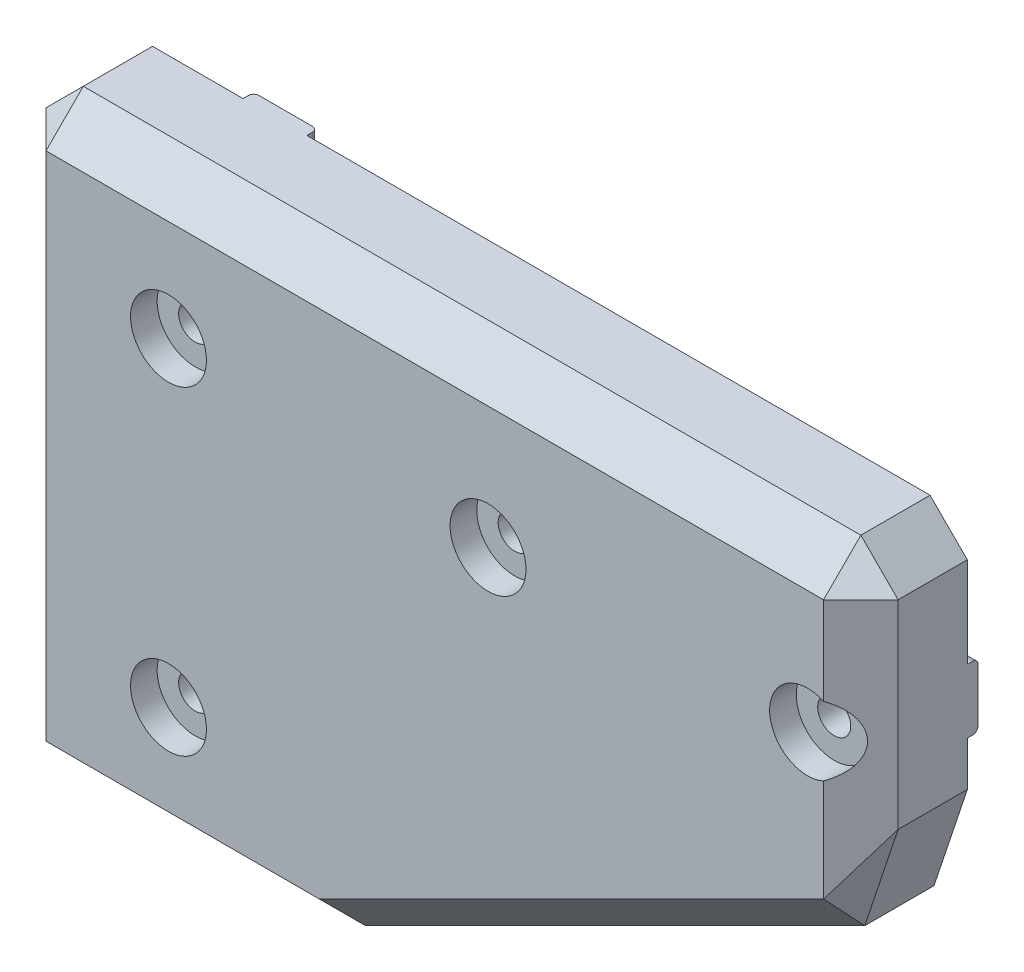
ISO-10303-21;
HEADER;
FILE_DESCRIPTION(('STEP AP214'),'2;1');
FILE_NAME('part.step','',(''),(''),'','','');
FILE_SCHEMA(('AUTOMOTIVE_DESIGN { 1 0 10303 214 1 1 1 1 }'));
ENDSEC;
DATA;
#1=APPLICATION_CONTEXT('core data for automotive mechanical design processes');
#2=APPLICATION_PROTOCOL_DEFINITION('international standard','automotive_design',2000,#1);
#3=PRODUCT_CONTEXT('',#1,'mechanical');
#4=PRODUCT('Part','Part','',(#3));
#5=PRODUCT_RELATED_PRODUCT_CATEGORY('part','',(#4));
#6=PRODUCT_DEFINITION_FORMATION('','',#4);
#7=PRODUCT_DEFINITION_CONTEXT('part definition',#1,'design');
#8=PRODUCT_DEFINITION('design','',#6,#7);
#9=PRODUCT_DEFINITION_SHAPE('','',#8);
#10=(LENGTH_UNIT() NAMED_UNIT(*) SI_UNIT(.MILLI.,.METRE.));
#11=(NAMED_UNIT(*) PLANE_ANGLE_UNIT() SI_UNIT($,.RADIAN.));
#12=(NAMED_UNIT(*) SI_UNIT($,.STERADIAN.) SOLID_ANGLE_UNIT());
#13=UNCERTAINTY_MEASURE_WITH_UNIT(LENGTH_MEASURE(1.E-05),#10,'distance_accuracy_value','');
#14=(GEOMETRIC_REPRESENTATION_CONTEXT(3) GLOBAL_UNCERTAINTY_ASSIGNED_CONTEXT((#13)) GLOBAL_UNIT_ASSIGNED_CONTEXT((#10,
#11,#12)) REPRESENTATION_CONTEXT('',''));
#15=CARTESIAN_POINT('',(0.,0.,0.));
#16=DIRECTION('',(0.,0.,1.));
#17=DIRECTION('',(1.,0.,0.));
#18=AXIS2_PLACEMENT_3D('',#15,#16,#17);
#19=CARTESIAN_POINT('',(0.,0.,0.));
#20=DIRECTION('',(0.,0.,1.));
#21=DIRECTION('',(1.,0.,0.));
#22=AXIS2_PLACEMENT_3D('',#19,#20,#21);
#23=PLANE('',#22);
#24=DIRECTION('',(-1.,0.,0.));
#25=VECTOR('',#24,1.);
#26=CARTESIAN_POINT('',(160.,110.,0.));
#27=LINE('',#26,#25);
#28=CARTESIAN_POINT('',(24.,110.,0.));
#29=VERTEX_POINT('',#28);
#30=CARTESIAN_POINT('',(7.00000000000001,110.,0.));
#31=VERTEX_POINT('',#30);
#32=EDGE_CURVE('E228',#29,#31,#27,.T.);
#33=ORIENTED_EDGE('',*,*,#32,.F.);
#34=DIRECTION('',(0.,-1.,0.));
#35=VECTOR('',#34,1.);
#36=CARTESIAN_POINT('',(24.,0.,0.));
#37=LINE('',#36,#35);
#38=CARTESIAN_POINT('',(24.,0.,0.));
#39=VERTEX_POINT('',#38);
#40=EDGE_CURVE('E213',#29,#39,#37,.T.);
#41=ORIENTED_EDGE('',*,*,#40,.T.);
#42=DIRECTION('',(1.,0.,0.));
#43=VECTOR('',#42,1.);
#44=CARTESIAN_POINT('',(0.,0.,0.));
#45=LINE('',#44,#43);
#46=CARTESIAN_POINT('',(6.99999999999998,0.,0.));
#47=VERTEX_POINT('',#46);
#48=EDGE_CURVE('E225',#47,#39,#45,.T.);
#49=ORIENTED_EDGE('',*,*,#48,.F.);
#50=DIRECTION('',(0.707106781186546,-0.707106781186549,0.));
#51=VECTOR('',#50,1.);
#52=CARTESIAN_POINT('',(6.99999999999998,0.,0.));
#53=LINE('',#52,#51);
#54=CARTESIAN_POINT('',(0.,7.00000000000001,0.));
#55=VERTEX_POINT('',#54);
#56=EDGE_CURVE('E295',#47,#55,#53,.F.);
#57=ORIENTED_EDGE('',*,*,#56,.T.);
#58=DIRECTION('',(0.,-1.,0.));
#59=VECTOR('',#58,1.);
#60=CARTESIAN_POINT('',(0.,110.,0.));
#61=LINE('',#60,#59);
#62=CARTESIAN_POINT('',(0.,103.,0.));
#63=VERTEX_POINT('',#62);
#64=EDGE_CURVE('E245',#63,#55,#61,.T.);
#65=ORIENTED_EDGE('',*,*,#64,.F.);
#66=DIRECTION('',(-0.707106781186548,-0.707106781186547,0.));
#67=VECTOR('',#66,1.);
#68=CARTESIAN_POINT('',(0.,103.,0.));
#69=LINE('',#68,#67);
#70=EDGE_CURVE('E292',#63,#31,#69,.F.);
#71=ORIENTED_EDGE('',*,*,#70,.T.);
#72=EDGE_LOOP('',(#33,#41,#49,#57,#65,#71));
#73=FACE_BOUND('',#72,.T.);
#74=ADVANCED_FACE('F41',(#73),#23,.F.);
#75=CARTESIAN_POINT('',(150.,80.,20.));
#76=DIRECTION('',(0.,0.,-1.));
#77=DIRECTION('',(-1.,0.,0.));
#78=AXIS2_PLACEMENT_3D('',#75,#76,#77);
#79=CYLINDRICAL_SURFACE('',#78,3.09999999999999);
#80=CARTESIAN_POINT('',(150.,80.,15.));
#81=DIRECTION('',(0.,0.,1.));
#82=DIRECTION('',(1.,0.,0.));
#83=AXIS2_PLACEMENT_3D('',#80,#81,#82);
#84=CIRCLE('',#83,3.09999999999999);
#85=CARTESIAN_POINT('',(153.1,80.,15.));
#86=VERTEX_POINT('',#85);
#87=EDGE_CURVE('E275',#86,#86,#84,.T.);
#88=ORIENTED_EDGE('',*,*,#87,.T.);
#89=EDGE_LOOP('',(#88));
#90=FACE_BOUND('',#89,.T.);
#91=CARTESIAN_POINT('',(150.,80.,-2.));
#92=DIRECTION('',(0.,0.,1.));
#93=DIRECTION('',(1.,0.,0.));
#94=AXIS2_PLACEMENT_3D('',#91,#92,#93);
#95=CIRCLE('',#94,3.09999999999999);
#96=CARTESIAN_POINT('',(153.1,80.,-2.));
#97=VERTEX_POINT('',#96);
#98=EDGE_CURVE('E773',#97,#97,#95,.T.);
#99=ORIENTED_EDGE('',*,*,#98,.F.);
#100=EDGE_LOOP('',(#99));
#101=FACE_BOUND('',#100,.T.);
#102=ADVANCED_FACE('F546',(#90,#101),#79,.F.);
#103=CARTESIAN_POINT('',(90.,80.,20.));
#104=DIRECTION('',(0.,0.,-1.));
#105=DIRECTION('',(-1.,0.,0.));
#106=AXIS2_PLACEMENT_3D('',#103,#104,#105);
#107=CYLINDRICAL_SURFACE('',#106,3.1);
#108=CARTESIAN_POINT('',(90.,80.,15.));
#109=DIRECTION('',(0.,0.,1.));
#110=DIRECTION('',(1.,0.,0.));
#111=AXIS2_PLACEMENT_3D('',#108,#109,#110);
#112=CIRCLE('',#111,3.1);
#113=CARTESIAN_POINT('',(93.1,80.,15.));
#114=VERTEX_POINT('',#113);
#115=EDGE_CURVE('E271',#114,#114,#112,.T.);
#116=ORIENTED_EDGE('',*,*,#115,.T.);
#117=EDGE_LOOP('',(#116));
#118=FACE_BOUND('',#117,.T.);
#119=CARTESIAN_POINT('',(90.,80.,-2.));
#120=DIRECTION('',(0.,0.,1.));
#121=DIRECTION('',(1.,0.,0.));
#122=AXIS2_PLACEMENT_3D('',#119,#120,#121);
#123=CIRCLE('',#122,3.1);
#124=CARTESIAN_POINT('',(93.1,80.,-2.));
#125=VERTEX_POINT('',#124);
#126=EDGE_CURVE('E769',#125,#125,#123,.T.);
#127=ORIENTED_EDGE('',*,*,#126,.F.);
#128=EDGE_LOOP('',(#127));
#129=FACE_BOUND('',#128,.T.);
#130=ADVANCED_FACE('F550',(#118,#129),#107,.F.);
#131=CARTESIAN_POINT('',(30.,84.,20.));
#132=DIRECTION('',(0.,0.,-1.));
#133=DIRECTION('',(-1.,0.,0.));
#134=AXIS2_PLACEMENT_3D('',#131,#132,#133);
#135=CYLINDRICAL_SURFACE('',#134,3.10000000000001);
#136=CARTESIAN_POINT('',(30.,84.,15.));
#137=DIRECTION('',(0.,0.,1.));
#138=DIRECTION('',(1.,0.,0.));
#139=AXIS2_PLACEMENT_3D('',#136,#137,#138);
#140=CIRCLE('',#139,3.10000000000001);
#141=CARTESIAN_POINT('',(33.1,84.,15.));
#142=VERTEX_POINT('',#141);
#143=EDGE_CURVE('E266',#142,#142,#140,.T.);
#144=ORIENTED_EDGE('',*,*,#143,.T.);
#145=EDGE_LOOP('',(#144));
#146=FACE_BOUND('',#145,.T.);
#147=CARTESIAN_POINT('',(30.,84.,-2.));
#148=DIRECTION('',(0.,0.,1.));
#149=DIRECTION('',(1.,0.,0.));
#150=AXIS2_PLACEMENT_3D('',#147,#148,#149);
#151=CIRCLE('',#150,3.10000000000001);
#152=CARTESIAN_POINT('',(33.1,84.,-2.));
#153=VERTEX_POINT('',#152);
#154=EDGE_CURVE('E772',#153,#153,#151,.T.);
#155=ORIENTED_EDGE('',*,*,#154,.F.);
#156=EDGE_LOOP('',(#155));
#157=FACE_BOUND('',#156,.T.);
#158=ADVANCED_FACE('F756',(#146,#157),#135,.F.);
#159=CARTESIAN_POINT('',(30.,24.,20.));
#160=DIRECTION('',(0.,0.,-1.));
#161=DIRECTION('',(-1.,0.,0.));
#162=AXIS2_PLACEMENT_3D('',#159,#160,#161);
#163=CYLINDRICAL_SURFACE('',#162,3.1);
#164=CARTESIAN_POINT('',(30.,24.,15.));
#165=DIRECTION('',(0.,0.,1.));
#166=DIRECTION('',(1.,0.,0.));
#167=AXIS2_PLACEMENT_3D('',#164,#165,#166);
#168=CIRCLE('',#167,3.1);
#169=CARTESIAN_POINT('',(33.1,24.,15.));
#170=VERTEX_POINT('',#169);
#171=EDGE_CURVE('E262',#170,#170,#168,.T.);
#172=ORIENTED_EDGE('',*,*,#171,.T.);
#173=EDGE_LOOP('',(#172));
#174=FACE_BOUND('',#173,.T.);
#175=CARTESIAN_POINT('',(30.,24.,-2.));
#176=DIRECTION('',(0.,0.,1.));
#177=DIRECTION('',(1.,0.,0.));
#178=AXIS2_PLACEMENT_3D('',#175,#176,#177);
#179=CIRCLE('',#178,3.1);
#180=CARTESIAN_POINT('',(33.1,24.,-2.));
#181=VERTEX_POINT('',#180);
#182=EDGE_CURVE('E231',#181,#181,#179,.T.);
#183=ORIENTED_EDGE('',*,*,#182,.F.);
#184=EDGE_LOOP('',(#183));
#185=FACE_BOUND('',#184,.T.);
#186=ADVANCED_FACE('F564',(#174,#185),#163,.F.);
#187=CARTESIAN_POINT('',(0.,110.,20.));
#188=DIRECTION('',(1.,0.,0.));
#189=DIRECTION('',(0.,1.,0.));
#190=AXIS2_PLACEMENT_3D('',#187,#188,#189);
#191=PLANE('',#190);
#192=ORIENTED_EDGE('',*,*,#64,.T.);
#193=DIRECTION('',(0.,0.,1.));
#194=VECTOR('',#193,1.);
#195=CARTESIAN_POINT('',(0.,7.00000000000001,20.));
#196=LINE('',#195,#194);
#197=CARTESIAN_POINT('',(0.,7.00000000000001,13.));
#198=VERTEX_POINT('',#197);
#199=EDGE_CURVE('E318',#55,#198,#196,.T.);
#200=ORIENTED_EDGE('',*,*,#199,.T.);
#201=DIRECTION('',(0.,1.,0.));
#202=VECTOR('',#201,1.);
#203=CARTESIAN_POINT('',(0.,110.,13.));
#204=LINE('',#203,#202);
#205=CARTESIAN_POINT('',(0.,103.,13.));
#206=VERTEX_POINT('',#205);
#207=EDGE_CURVE('E312',#198,#206,#204,.T.);
#208=ORIENTED_EDGE('',*,*,#207,.T.);
#209=DIRECTION('',(0.,0.,-1.));
#210=VECTOR('',#209,1.);
#211=CARTESIAN_POINT('',(0.,103.,20.));
#212=LINE('',#211,#210);
#213=EDGE_CURVE('E315',#206,#63,#212,.T.);
#214=ORIENTED_EDGE('',*,*,#213,.T.);
#215=EDGE_LOOP('',(#192,#200,#208,#214));
#216=FACE_BOUND('',#215,.T.);
#217=ADVANCED_FACE('F561',(#216),#191,.F.);
#218=CARTESIAN_POINT('',(0.,0.,20.));
#219=DIRECTION('',(0.,1.,0.));
#220=DIRECTION('',(0.,0.,1.));
#221=AXIS2_PLACEMENT_3D('',#218,#219,#220);
#222=PLANE('',#221);
#223=DIRECTION('',(0.,0.,1.));
#224=VECTOR('',#223,1.);
#225=CARTESIAN_POINT('',(24.,0.,-2.));
#226=LINE('',#225,#224);
#227=CARTESIAN_POINT('',(24.,0.,-1.));
#228=VERTEX_POINT('',#227);
#229=EDGE_CURVE('E209',#228,#39,#226,.T.);
#230=ORIENTED_EDGE('',*,*,#229,.F.);
#231=CARTESIAN_POINT('',(25.,0.,-1.));
#232=DIRECTION('',(0.,1.,0.));
#233=DIRECTION('',(0.,0.,1.));
#234=AXIS2_PLACEMENT_3D('',#231,#232,#233);
#235=CIRCLE('',#234,1.);
#236=CARTESIAN_POINT('',(25.,0.,-2.));
#237=VERTEX_POINT('',#236);
#238=EDGE_CURVE('E411',#228,#237,#235,.F.);
#239=ORIENTED_EDGE('',*,*,#238,.T.);
#240=DIRECTION('',(1.,0.,0.));
#241=VECTOR('',#240,1.);
#242=CARTESIAN_POINT('',(36.,0.,-2.));
#243=LINE('',#242,#241);
#244=CARTESIAN_POINT('',(35.,0.,-2.));
#245=VERTEX_POINT('',#244);
#246=EDGE_CURVE('E783',#237,#245,#243,.T.);
#247=ORIENTED_EDGE('',*,*,#246,.T.);
#248=CARTESIAN_POINT('',(35.,0.,-1.));
#249=DIRECTION('',(0.,1.,0.));
#250=DIRECTION('',(0.,0.,1.));
#251=AXIS2_PLACEMENT_3D('',#248,#249,#250);
#252=CIRCLE('',#251,1.);
#253=CARTESIAN_POINT('',(36.,0.,-1.));
#254=VERTEX_POINT('',#253);
#255=EDGE_CURVE('E408',#245,#254,#252,.F.);
#256=ORIENTED_EDGE('',*,*,#255,.T.);
#257=DIRECTION('',(0.,0.,1.));
#258=VECTOR('',#257,1.);
#259=CARTESIAN_POINT('',(36.,0.,-2.));
#260=LINE('',#259,#258);
#261=CARTESIAN_POINT('',(36.,0.,0.));
#262=VERTEX_POINT('',#261);
#263=EDGE_CURVE('E220',#254,#262,#260,.T.);
#264=ORIENTED_EDGE('',*,*,#263,.T.);
#265=CARTESIAN_POINT('',(60.,0.,0.));
#266=VERTEX_POINT('',#265);
#267=EDGE_CURVE('E238',#262,#266,#45,.T.);
#268=ORIENTED_EDGE('',*,*,#267,.T.);
#269=DIRECTION('',(0.,0.,-1.));
#270=VECTOR('',#269,1.);
#271=CARTESIAN_POINT('',(60.,0.,20.));
#272=LINE('',#271,#270);
#273=CARTESIAN_POINT('',(60.,0.,13.));
#274=VERTEX_POINT('',#273);
#275=EDGE_CURVE('E257',#274,#266,#272,.T.);
#276=ORIENTED_EDGE('',*,*,#275,.F.);
#277=DIRECTION('',(-1.,0.,0.));
#278=VECTOR('',#277,1.);
#279=CARTESIAN_POINT('',(0.,0.,13.));
#280=LINE('',#279,#278);
#281=CARTESIAN_POINT('',(6.99999999999998,0.,13.));
#282=VERTEX_POINT('',#281);
#283=EDGE_CURVE('E307',#274,#282,#280,.T.);
#284=ORIENTED_EDGE('',*,*,#283,.T.);
#285=DIRECTION('',(0.,0.,-1.));
#286=VECTOR('',#285,1.);
#287=CARTESIAN_POINT('',(6.99999999999998,0.,20.));
#288=LINE('',#287,#286);
#289=EDGE_CURVE('E235',#282,#47,#288,.T.);
#290=ORIENTED_EDGE('',*,*,#289,.T.);
#291=ORIENTED_EDGE('',*,*,#48,.T.);
#292=EDGE_LOOP('',(#230,#239,#247,#256,#264,#268,#276,#284,#290,#291));
#293=FACE_BOUND('',#292,.T.);
#294=ADVANCED_FACE('F233',(#293),#222,.F.);
#295=CARTESIAN_POINT('',(60.,0.,20.));
#296=DIRECTION('',(-0.447213595499958,0.894427190999916,0.));
#297=DIRECTION('',(-0.894427190999916,-0.447213595499958,0.));
#298=AXIS2_PLACEMENT_3D('',#295,#296,#297);
#299=PLANE('',#298);
#300=DIRECTION('',(0.894427190999916,0.447213595499958,0.));
#301=VECTOR('',#300,1.);
#302=CARTESIAN_POINT('',(60.,0.,0.));
#303=LINE('',#302,#301);
#304=CARTESIAN_POINT('',(153.739009663001,46.8695048315003,0.));
#305=VERTEX_POINT('',#304);
#306=EDGE_CURVE('E237',#266,#305,#303,.T.);
#307=ORIENTED_EDGE('',*,*,#306,.T.);
#308=DIRECTION('',(0.,0.,1.));
#309=VECTOR('',#308,1.);
#310=CARTESIAN_POINT('',(153.739009663001,46.8695048315003,20.));
#311=LINE('',#310,#309);
#312=CARTESIAN_POINT('',(153.739009663001,46.8695048315003,13.));
#313=VERTEX_POINT('',#312);
#314=EDGE_CURVE('E304',#305,#313,#311,.T.);
#315=ORIENTED_EDGE('',*,*,#314,.T.);
#316=DIRECTION('',(-0.894427190999916,-0.447213595499958,0.));
#317=VECTOR('',#316,1.);
#318=CARTESIAN_POINT('',(60.,0.,13.));
#319=LINE('',#318,#317);
#320=EDGE_CURVE('E301',#313,#274,#319,.T.);
#321=ORIENTED_EDGE('',*,*,#320,.T.);
#322=ORIENTED_EDGE('',*,*,#275,.T.);
#323=EDGE_LOOP('',(#307,#315,#321,#322));
#324=FACE_BOUND('',#323,.T.);
#325=ADVANCED_FACE('F555',(#324),#299,.F.);
#326=CARTESIAN_POINT('',(160.,50.,20.));
#327=DIRECTION('',(-1.,0.,0.));
#328=DIRECTION('',(0.,0.,1.));
#329=AXIS2_PLACEMENT_3D('',#326,#327,#328);
#330=PLANE('',#329);
#331=DIRECTION('',(0.,0.,1.));
#332=VECTOR('',#331,1.);
#333=CARTESIAN_POINT('',(160.,74.,-2.));
#334=LINE('',#333,#332);
#335=CARTESIAN_POINT('',(160.,74.,-1.));
#336=VERTEX_POINT('',#335);
#337=CARTESIAN_POINT('',(160.,74.,0.));
#338=VERTEX_POINT('',#337);
#339=EDGE_CURVE('E464',#336,#338,#334,.T.);
#340=ORIENTED_EDGE('',*,*,#339,.F.);
#341=CARTESIAN_POINT('',(160.,75.,-1.));
#342=DIRECTION('',(-1.,0.,0.));
#343=DIRECTION('',(0.,0.,1.));
#344=AXIS2_PLACEMENT_3D('',#341,#342,#343);
#345=CIRCLE('',#344,1.);
#346=CARTESIAN_POINT('',(160.,75.,-2.));
#347=VERTEX_POINT('',#346);
#348=EDGE_CURVE('E437',#336,#347,#345,.F.);
#349=ORIENTED_EDGE('',*,*,#348,.T.);
#350=DIRECTION('',(0.,1.,0.));
#351=VECTOR('',#350,1.);
#352=CARTESIAN_POINT('',(160.,86.,-2.));
#353=LINE('',#352,#351);
#354=CARTESIAN_POINT('',(160.,85.,-2.));
#355=VERTEX_POINT('',#354);
#356=EDGE_CURVE('E465',#347,#355,#353,.T.);
#357=ORIENTED_EDGE('',*,*,#356,.T.);
#358=CARTESIAN_POINT('',(160.,85.,-1.));
#359=DIRECTION('',(-1.,0.,0.));
#360=DIRECTION('',(0.,0.,1.));
#361=AXIS2_PLACEMENT_3D('',#358,#359,#360);
#362=CIRCLE('',#361,1.);
#363=CARTESIAN_POINT('',(160.,86.,-1.));
#364=VERTEX_POINT('',#363);
#365=EDGE_CURVE('E434',#355,#364,#362,.F.);
#366=ORIENTED_EDGE('',*,*,#365,.T.);
#367=DIRECTION('',(0.,0.,1.));
#368=VECTOR('',#367,1.);
#369=CARTESIAN_POINT('',(160.,86.,-2.));
#370=LINE('',#369,#368);
#371=CARTESIAN_POINT('',(160.,86.,0.));
#372=VERTEX_POINT('',#371);
#373=EDGE_CURVE('E490',#364,#372,#370,.T.);
#374=ORIENTED_EDGE('',*,*,#373,.T.);
#375=DIRECTION('',(0.,1.,0.));
#376=VECTOR('',#375,1.);
#377=CARTESIAN_POINT('',(160.,50.,0.));
#378=LINE('',#377,#376);
#379=CARTESIAN_POINT('',(160.,103.,0.));
#380=VERTEX_POINT('',#379);
#381=EDGE_CURVE('E243',#372,#380,#378,.T.);
#382=ORIENTED_EDGE('',*,*,#381,.T.);
#383=DIRECTION('',(0.,0.,1.));
#384=VECTOR('',#383,1.);
#385=CARTESIAN_POINT('',(160.,103.,20.));
#386=LINE('',#385,#384);
#387=CARTESIAN_POINT('',(160.,103.,13.));
#388=VERTEX_POINT('',#387);
#389=EDGE_CURVE('E281',#380,#388,#386,.T.);
#390=ORIENTED_EDGE('',*,*,#389,.T.);
#391=DIRECTION('',(0.,-1.,0.));
#392=VECTOR('',#391,1.);
#393=CARTESIAN_POINT('',(160.,50.,13.));
#394=LINE('',#393,#392);
#395=CARTESIAN_POINT('',(160.,65.6524758424984,13.));
#396=VERTEX_POINT('',#395);
#397=EDGE_CURVE('E261',#388,#396,#394,.T.);
#398=ORIENTED_EDGE('',*,*,#397,.T.);
#399=DIRECTION('',(0.,0.,-1.));
#400=VECTOR('',#399,1.);
#401=CARTESIAN_POINT('',(160.,65.6524758424984,20.));
#402=LINE('',#401,#400);
#403=CARTESIAN_POINT('',(160.,65.6524758424984,0.));
#404=VERTEX_POINT('',#403);
#405=EDGE_CURVE('E284',#396,#404,#402,.T.);
#406=ORIENTED_EDGE('',*,*,#405,.T.);
#407=EDGE_CURVE('E249',#404,#338,#378,.T.);
#408=ORIENTED_EDGE('',*,*,#407,.T.);
#409=EDGE_LOOP('',(#340,#349,#357,#366,#374,#382,#390,#398,#406,#408));
#410=FACE_BOUND('',#409,.T.);
#411=ADVANCED_FACE('F470',(#410),#330,.F.);
#412=CARTESIAN_POINT('',(160.,110.,20.));
#413=DIRECTION('',(0.,-1.,0.));
#414=DIRECTION('',(1.,0.,0.));
#415=AXIS2_PLACEMENT_3D('',#412,#413,#414);
#416=PLANE('',#415);
#417=DIRECTION('',(-1.,0.,0.));
#418=VECTOR('',#417,1.);
#419=CARTESIAN_POINT('',(36.,110.,-2.));
#420=LINE('',#419,#418);
#421=CARTESIAN_POINT('',(35.,110.,-2.));
#422=VERTEX_POINT('',#421);
#423=CARTESIAN_POINT('',(25.,110.,-2.));
#424=VERTEX_POINT('',#423);
#425=EDGE_CURVE('E221',#422,#424,#420,.T.);
#426=ORIENTED_EDGE('',*,*,#425,.T.);
#427=CARTESIAN_POINT('',(25.,110.,-1.));
#428=DIRECTION('',(0.,-1.,0.));
#429=DIRECTION('',(1.,0.,0.));
#430=AXIS2_PLACEMENT_3D('',#427,#428,#429);
#431=CIRCLE('',#430,1.);
#432=CARTESIAN_POINT('',(24.,110.,-1.));
#433=VERTEX_POINT('',#432);
#434=EDGE_CURVE('E423',#424,#433,#431,.F.);
#435=ORIENTED_EDGE('',*,*,#434,.T.);
#436=DIRECTION('',(0.,0.,1.));
#437=VECTOR('',#436,1.);
#438=CARTESIAN_POINT('',(24.,110.,-2.));
#439=LINE('',#438,#437);
#440=EDGE_CURVE('E482',#433,#29,#439,.T.);
#441=ORIENTED_EDGE('',*,*,#440,.T.);
#442=ORIENTED_EDGE('',*,*,#32,.T.);
#443=DIRECTION('',(0.,0.,1.));
#444=VECTOR('',#443,1.);
#445=CARTESIAN_POINT('',(7.00000000000001,110.,20.));
#446=LINE('',#445,#444);
#447=CARTESIAN_POINT('',(7.00000000000001,110.,13.));
#448=VERTEX_POINT('',#447);
#449=EDGE_CURVE('E327',#31,#448,#446,.T.);
#450=ORIENTED_EDGE('',*,*,#449,.T.);
#451=DIRECTION('',(1.,0.,0.));
#452=VECTOR('',#451,1.);
#453=CARTESIAN_POINT('',(160.,110.,13.));
#454=LINE('',#453,#452);
#455=CARTESIAN_POINT('',(153.,110.,13.));
#456=VERTEX_POINT('',#455);
#457=EDGE_CURVE('E321',#448,#456,#454,.T.);
#458=ORIENTED_EDGE('',*,*,#457,.T.);
#459=DIRECTION('',(0.,0.,-1.));
#460=VECTOR('',#459,1.);
#461=CARTESIAN_POINT('',(153.,110.,20.));
#462=LINE('',#461,#460);
#463=CARTESIAN_POINT('',(153.,110.,0.));
#464=VERTEX_POINT('',#463);
#465=EDGE_CURVE('E324',#456,#464,#462,.T.);
#466=ORIENTED_EDGE('',*,*,#465,.T.);
#467=CARTESIAN_POINT('',(36.,110.,0.));
#468=VERTEX_POINT('',#467);
#469=EDGE_CURVE('E253',#464,#468,#27,.T.);
#470=ORIENTED_EDGE('',*,*,#469,.T.);
#471=DIRECTION('',(0.,0.,1.));
#472=VECTOR('',#471,1.);
#473=CARTESIAN_POINT('',(36.,110.,-2.));
#474=LINE('',#473,#472);
#475=CARTESIAN_POINT('',(36.,110.,-1.));
#476=VERTEX_POINT('',#475);
#477=EDGE_CURVE('E794',#476,#468,#474,.T.);
#478=ORIENTED_EDGE('',*,*,#477,.F.);
#479=CARTESIAN_POINT('',(35.,110.,-1.));
#480=DIRECTION('',(0.,-1.,0.));
#481=DIRECTION('',(1.,0.,0.));
#482=AXIS2_PLACEMENT_3D('',#479,#480,#481);
#483=CIRCLE('',#482,1.);
#484=EDGE_CURVE('E420',#476,#422,#483,.F.);
#485=ORIENTED_EDGE('',*,*,#484,.T.);
#486=EDGE_LOOP('',(#426,#435,#441,#442,#450,#458,#466,#470,#478,#485));
#487=FACE_BOUND('',#486,.T.);
#488=ADVANCED_FACE('F530',(#487),#416,.F.);
#489=CARTESIAN_POINT('',(0.,0.,20.));
#490=DIRECTION('',(0.,0.,1.));
#491=DIRECTION('',(1.,0.,0.));
#492=AXIS2_PLACEMENT_3D('',#489,#490,#491);
#493=PLANE('',#492);
#494=CARTESIAN_POINT('',(30.,24.,20.));
#495=DIRECTION('',(0.,0.,1.));
#496=DIRECTION('',(1.,0.,0.));
#497=AXIS2_PLACEMENT_3D('',#494,#495,#496);
#498=CIRCLE('',#497,7.12808554784318);
#499=CARTESIAN_POINT('',(37.1280855478432,24.,20.));
#500=VERTEX_POINT('',#499);
#501=EDGE_CURVE('E405',#500,#500,#498,.T.);
#502=ORIENTED_EDGE('',*,*,#501,.F.);
#503=EDGE_LOOP('',(#502));
#504=FACE_BOUND('',#503,.T.);
#505=DIRECTION('',(0.894427190999916,0.447213595499958,0.));
#506=VECTOR('',#505,1.);
#507=CARTESIAN_POINT('',(156.8695048315,56.2609903369994,20.));
#508=LINE('',#507,#506);
#509=CARTESIAN_POINT('',(58.3475241575015,6.99999999999998,20.));
#510=VERTEX_POINT('',#509);
#511=CARTESIAN_POINT('',(153.,54.3262379212493,20.));
#512=VERTEX_POINT('',#511);
#513=EDGE_CURVE('E339',#510,#512,#508,.T.);
#514=ORIENTED_EDGE('',*,*,#513,.T.);
#515=DIRECTION('',(0.,1.,0.));
#516=VECTOR('',#515,1.);
#517=CARTESIAN_POINT('',(153.,110.,20.));
#518=LINE('',#517,#516);
#519=CARTESIAN_POINT('',(153.,73.5339653900268,20.));
#520=VERTEX_POINT('',#519);
#521=EDGE_CURVE('E345',#512,#520,#518,.T.);
#522=ORIENTED_EDGE('',*,*,#521,.T.);
#523=CARTESIAN_POINT('',(150.,80.,20.));
#524=DIRECTION('',(0.,0.,1.));
#525=DIRECTION('',(1.,0.,0.));
#526=AXIS2_PLACEMENT_3D('',#523,#524,#525);
#527=CIRCLE('',#526,7.12808554784321);
#528=CARTESIAN_POINT('',(153.,86.4660346099732,20.));
#529=VERTEX_POINT('',#528);
#530=EDGE_CURVE('E508',#529,#520,#527,.T.);
#531=ORIENTED_EDGE('',*,*,#530,.F.);
#532=DIRECTION('',(0.,1.,0.));
#533=VECTOR('',#532,1.);
#534=CARTESIAN_POINT('',(153.,110.,20.));
#535=LINE('',#534,#533);
#536=CARTESIAN_POINT('',(153.,103.,20.));
#537=VERTEX_POINT('',#536);
#538=EDGE_CURVE('E342',#529,#537,#535,.T.);
#539=ORIENTED_EDGE('',*,*,#538,.T.);
#540=DIRECTION('',(-1.,0.,0.));
#541=VECTOR('',#540,1.);
#542=CARTESIAN_POINT('',(0.,103.,20.));
#543=LINE('',#542,#541);
#544=CARTESIAN_POINT('',(6.99999999999999,103.,20.));
#545=VERTEX_POINT('',#544);
#546=EDGE_CURVE('E330',#537,#545,#543,.T.);
#547=ORIENTED_EDGE('',*,*,#546,.T.);
#548=DIRECTION('',(0.,-1.,0.));
#549=VECTOR('',#548,1.);
#550=CARTESIAN_POINT('',(6.99999999999998,0.,20.));
#551=LINE('',#550,#549);
#552=CARTESIAN_POINT('',(6.99999999999998,6.99999999999998,20.));
#553=VERTEX_POINT('',#552);
#554=EDGE_CURVE('E333',#545,#553,#551,.T.);
#555=ORIENTED_EDGE('',*,*,#554,.T.);
#556=DIRECTION('',(1.,0.,0.));
#557=VECTOR('',#556,1.);
#558=CARTESIAN_POINT('',(60.,6.99999999999998,20.));
#559=LINE('',#558,#557);
#560=EDGE_CURVE('E336',#553,#510,#559,.T.);
#561=ORIENTED_EDGE('',*,*,#560,.T.);
#562=EDGE_LOOP('',(#514,#522,#531,#539,#547,#555,#561));
#563=FACE_BOUND('',#562,.T.);
#564=CARTESIAN_POINT('',(90.,80.,20.));
#565=DIRECTION('',(0.,0.,1.));
#566=DIRECTION('',(1.,0.,0.));
#567=AXIS2_PLACEMENT_3D('',#564,#565,#566);
#568=CIRCLE('',#567,7.12808554784319);
#569=CARTESIAN_POINT('',(97.1280855478432,80.,20.));
#570=VERTEX_POINT('',#569);
#571=EDGE_CURVE('E500',#570,#570,#568,.T.);
#572=ORIENTED_EDGE('',*,*,#571,.F.);
#573=EDGE_LOOP('',(#572));
#574=FACE_BOUND('',#573,.T.);
#575=CARTESIAN_POINT('',(30.,84.,20.));
#576=DIRECTION('',(0.,0.,1.));
#577=DIRECTION('',(1.,0.,0.));
#578=AXIS2_PLACEMENT_3D('',#575,#576,#577);
#579=CIRCLE('',#578,7.12808554784319);
#580=CARTESIAN_POINT('',(37.1280855478432,84.,20.));
#581=VERTEX_POINT('',#580);
#582=EDGE_CURVE('E499',#581,#581,#579,.T.);
#583=ORIENTED_EDGE('',*,*,#582,.F.);
#584=EDGE_LOOP('',(#583));
#585=FACE_BOUND('',#584,.T.);
#586=ADVANCED_FACE('F527',(#504,#563,#574,#585),#493,.T.);
#587=ORIENTED_EDGE('',*,*,#267,.F.);
#588=DIRECTION('',(0.,1.,0.));
#589=VECTOR('',#588,1.);
#590=CARTESIAN_POINT('',(36.,0.,0.));
#591=LINE('',#590,#589);
#592=EDGE_CURVE('E230',#262,#468,#591,.T.);
#593=ORIENTED_EDGE('',*,*,#592,.T.);
#594=ORIENTED_EDGE('',*,*,#469,.F.);
#595=DIRECTION('',(-0.707106781186549,0.707106781186546,0.));
#596=VECTOR('',#595,1.);
#597=CARTESIAN_POINT('',(153.,110.,0.));
#598=LINE('',#597,#596);
#599=EDGE_CURVE('E288',#464,#380,#598,.F.);
#600=ORIENTED_EDGE('',*,*,#599,.T.);
#601=ORIENTED_EDGE('',*,*,#381,.F.);
#602=DIRECTION('',(-1.,0.,0.));
#603=VECTOR('',#602,1.);
#604=CARTESIAN_POINT('',(160.,86.,0.));
#605=LINE('',#604,#603);
#606=CARTESIAN_POINT('',(65.,86.,0.));
#607=VERTEX_POINT('',#606);
#608=EDGE_CURVE('E476',#372,#607,#605,.T.);
#609=ORIENTED_EDGE('',*,*,#608,.T.);
#610=DIRECTION('',(0.,-1.,0.));
#611=VECTOR('',#610,1.);
#612=CARTESIAN_POINT('',(65.,86.,0.));
#613=LINE('',#612,#611);
#614=CARTESIAN_POINT('',(65.,74.,0.));
#615=VERTEX_POINT('',#614);
#616=EDGE_CURVE('E479',#607,#615,#613,.T.);
#617=ORIENTED_EDGE('',*,*,#616,.T.);
#618=DIRECTION('',(1.,0.,0.));
#619=VECTOR('',#618,1.);
#620=CARTESIAN_POINT('',(160.,74.,0.));
#621=LINE('',#620,#619);
#622=EDGE_CURVE('E461',#615,#338,#621,.T.);
#623=ORIENTED_EDGE('',*,*,#622,.T.);
#624=ORIENTED_EDGE('',*,*,#407,.F.);
#625=DIRECTION('',(0.31622776601684,0.948683298050513,0.));
#626=VECTOR('',#625,1.);
#627=CARTESIAN_POINT('',(160.,65.6524758424984,0.));
#628=LINE('',#627,#626);
#629=EDGE_CURVE('E298',#404,#305,#628,.F.);
#630=ORIENTED_EDGE('',*,*,#629,.T.);
#631=ORIENTED_EDGE('',*,*,#306,.F.);
#632=EDGE_LOOP('',(#587,#593,#594,#600,#601,#609,#617,#623,#624,#630,#631));
#633=FACE_BOUND('',#632,.T.);
#634=ADVANCED_FACE('F529',(#633),#23,.F.);
#635=CARTESIAN_POINT('',(30.,24.,15.));
#636=DIRECTION('',(0.,0.,1.));
#637=DIRECTION('',(1.,0.,0.));
#638=AXIS2_PLACEMENT_3D('',#635,#636,#637);
#639=CYLINDRICAL_SURFACE('',#638,7.12808554784318);
#640=CARTESIAN_POINT('',(30.,24.,15.));
#641=DIRECTION('',(0.,0.,1.));
#642=DIRECTION('',(1.,0.,0.));
#643=AXIS2_PLACEMENT_3D('',#640,#641,#642);
#644=CIRCLE('',#643,7.12808554784318);
#645=CARTESIAN_POINT('',(37.1280855478432,24.,15.));
#646=VERTEX_POINT('',#645);
#647=EDGE_CURVE('E512',#646,#646,#644,.T.);
#648=ORIENTED_EDGE('',*,*,#647,.F.);
#649=EDGE_LOOP('',(#648));
#650=FACE_BOUND('',#649,.T.);
#651=ORIENTED_EDGE('',*,*,#501,.T.);
#652=EDGE_LOOP('',(#651));
#653=FACE_BOUND('',#652,.T.);
#654=ADVANCED_FACE('F537',(#650,#653),#639,.F.);
#655=CARTESIAN_POINT('',(30.,24.,15.));
#656=DIRECTION('',(0.,0.,1.));
#657=DIRECTION('',(1.,0.,0.));
#658=AXIS2_PLACEMENT_3D('',#655,#656,#657);
#659=PLANE('',#658);
#660=ORIENTED_EDGE('',*,*,#171,.F.);
#661=EDGE_LOOP('',(#660));
#662=FACE_BOUND('',#661,.T.);
#663=ORIENTED_EDGE('',*,*,#647,.T.);
#664=EDGE_LOOP('',(#663));
#665=FACE_BOUND('',#664,.T.);
#666=ADVANCED_FACE('F740',(#662,#665),#659,.T.);
#667=CARTESIAN_POINT('',(30.,84.,15.));
#668=DIRECTION('',(0.,0.,1.));
#669=DIRECTION('',(1.,0.,0.));
#670=AXIS2_PLACEMENT_3D('',#667,#668,#669);
#671=CYLINDRICAL_SURFACE('',#670,7.12808554784319);
#672=CARTESIAN_POINT('',(30.,84.,15.));
#673=DIRECTION('',(0.,0.,1.));
#674=DIRECTION('',(1.,0.,0.));
#675=AXIS2_PLACEMENT_3D('',#672,#673,#674);
#676=CIRCLE('',#675,7.12808554784319);
#677=CARTESIAN_POINT('',(37.1280855478432,84.,15.));
#678=VERTEX_POINT('',#677);
#679=EDGE_CURVE('E267',#678,#678,#676,.T.);
#680=ORIENTED_EDGE('',*,*,#679,.F.);
#681=EDGE_LOOP('',(#680));
#682=FACE_BOUND('',#681,.T.);
#683=ORIENTED_EDGE('',*,*,#582,.T.);
#684=EDGE_LOOP('',(#683));
#685=FACE_BOUND('',#684,.T.);
#686=ADVANCED_FACE('F525',(#682,#685),#671,.F.);
#687=CARTESIAN_POINT('',(30.,84.,15.));
#688=DIRECTION('',(0.,0.,1.));
#689=DIRECTION('',(1.,0.,0.));
#690=AXIS2_PLACEMENT_3D('',#687,#688,#689);
#691=PLANE('',#690);
#692=ORIENTED_EDGE('',*,*,#143,.F.);
#693=EDGE_LOOP('',(#692));
#694=FACE_BOUND('',#693,.T.);
#695=ORIENTED_EDGE('',*,*,#679,.T.);
#696=EDGE_LOOP('',(#695));
#697=FACE_BOUND('',#696,.T.);
#698=ADVANCED_FACE('F747',(#694,#697),#691,.T.);
#699=CARTESIAN_POINT('',(90.,80.,15.));
#700=DIRECTION('',(0.,0.,1.));
#701=DIRECTION('',(1.,0.,0.));
#702=AXIS2_PLACEMENT_3D('',#699,#700,#701);
#703=CYLINDRICAL_SURFACE('',#702,7.12808554784319);
#704=CARTESIAN_POINT('',(90.,80.,15.));
#705=DIRECTION('',(0.,0.,1.));
#706=DIRECTION('',(1.,0.,0.));
#707=AXIS2_PLACEMENT_3D('',#704,#705,#706);
#708=CIRCLE('',#707,7.12808554784319);
#709=CARTESIAN_POINT('',(97.1280855478432,80.,15.));
#710=VERTEX_POINT('',#709);
#711=EDGE_CURVE('E495',#710,#710,#708,.T.);
#712=ORIENTED_EDGE('',*,*,#711,.F.);
#713=EDGE_LOOP('',(#712));
#714=FACE_BOUND('',#713,.T.);
#715=ORIENTED_EDGE('',*,*,#571,.T.);
#716=EDGE_LOOP('',(#715));
#717=FACE_BOUND('',#716,.T.);
#718=ADVANCED_FACE('F734',(#714,#717),#703,.F.);
#719=CARTESIAN_POINT('',(90.,80.,15.));
#720=DIRECTION('',(0.,0.,1.));
#721=DIRECTION('',(1.,0.,0.));
#722=AXIS2_PLACEMENT_3D('',#719,#720,#721);
#723=PLANE('',#722);
#724=ORIENTED_EDGE('',*,*,#115,.F.);
#725=EDGE_LOOP('',(#724));
#726=FACE_BOUND('',#725,.T.);
#727=ORIENTED_EDGE('',*,*,#711,.T.);
#728=EDGE_LOOP('',(#727));
#729=FACE_BOUND('',#728,.T.);
#730=ADVANCED_FACE('F725',(#726,#729),#723,.T.);
#731=CARTESIAN_POINT('',(150.,80.,15.));
#732=DIRECTION('',(0.,0.,1.));
#733=DIRECTION('',(1.,0.,0.));
#734=AXIS2_PLACEMENT_3D('',#731,#732,#733);
#735=CYLINDRICAL_SURFACE('',#734,7.12808554784321);
#736=CARTESIAN_POINT('',(150.,80.,15.));
#737=DIRECTION('',(0.,0.,1.));
#738=DIRECTION('',(1.,0.,0.));
#739=AXIS2_PLACEMENT_3D('',#736,#737,#738);
#740=CIRCLE('',#739,7.12808554784321);
#741=CARTESIAN_POINT('',(157.128085547843,80.,15.));
#742=VERTEX_POINT('',#741);
#743=EDGE_CURVE('E504',#742,#742,#740,.T.);
#744=ORIENTED_EDGE('',*,*,#743,.F.);
#745=EDGE_LOOP('',(#744));
#746=FACE_BOUND('',#745,.T.);
#747=ORIENTED_EDGE('',*,*,#530,.T.);
#748=CARTESIAN_POINT('',(150.,80.,23.));
#749=DIRECTION('',(0.707106781186549,0.,0.707106781186546));
#750=DIRECTION('',(-0.707106781186546,0.,0.707106781186549));
#751=AXIS2_PLACEMENT_3D('',#748,#749,#750);
#752=ELLIPSE('',#751,10.0806352555155,7.12808554784321);
#753=EDGE_CURVE('E349',#520,#529,#752,.T.);
#754=ORIENTED_EDGE('',*,*,#753,.T.);
#755=EDGE_LOOP('',(#747,#754));
#756=FACE_BOUND('',#755,.T.);
#757=ADVANCED_FACE('F723',(#746,#756),#735,.F.);
#758=CARTESIAN_POINT('',(150.,80.,15.));
#759=DIRECTION('',(0.,0.,1.));
#760=DIRECTION('',(1.,0.,0.));
#761=AXIS2_PLACEMENT_3D('',#758,#759,#760);
#762=PLANE('',#761);
#763=ORIENTED_EDGE('',*,*,#87,.F.);
#764=EDGE_LOOP('',(#763));
#765=FACE_BOUND('',#764,.T.);
#766=ORIENTED_EDGE('',*,*,#743,.T.);
#767=EDGE_LOOP('',(#766));
#768=FACE_BOUND('',#767,.T.);
#769=ADVANCED_FACE('F655',(#765,#768),#762,.T.);
#770=CARTESIAN_POINT('',(0.,103.,20.));
#771=DIRECTION('',(0.707106781186547,-0.707106781186548,0.));
#772=DIRECTION('',(0.,0.,-1.));
#773=AXIS2_PLACEMENT_3D('',#770,#771,#772);
#774=PLANE('',#773);
#775=ORIENTED_EDGE('',*,*,#70,.F.);
#776=ORIENTED_EDGE('',*,*,#213,.F.);
#777=DIRECTION('',(0.707106781186548,0.707106781186547,0.));
#778=VECTOR('',#777,1.);
#779=CARTESIAN_POINT('',(7.00000000000001,110.,13.));
#780=LINE('',#779,#778);
#781=EDGE_CURVE('E397',#448,#206,#780,.F.);
#782=ORIENTED_EDGE('',*,*,#781,.F.);
#783=ORIENTED_EDGE('',*,*,#449,.F.);
#784=EDGE_LOOP('',(#775,#776,#782,#783));
#785=FACE_BOUND('',#784,.T.);
#786=ADVANCED_FACE('F649',(#785),#774,.F.);
#787=CARTESIAN_POINT('',(6.99999999999998,0.,20.));
#788=DIRECTION('',(0.707106781186549,0.707106781186546,0.));
#789=DIRECTION('',(0.,0.,-1.));
#790=AXIS2_PLACEMENT_3D('',#787,#788,#789);
#791=PLANE('',#790);
#792=ORIENTED_EDGE('',*,*,#56,.F.);
#793=ORIENTED_EDGE('',*,*,#289,.F.);
#794=DIRECTION('',(-0.707106781186546,0.707106781186549,0.));
#795=VECTOR('',#794,1.);
#796=CARTESIAN_POINT('',(0.,7.00000000000001,13.));
#797=LINE('',#796,#795);
#798=EDGE_CURVE('E393',#198,#282,#797,.F.);
#799=ORIENTED_EDGE('',*,*,#798,.F.);
#800=ORIENTED_EDGE('',*,*,#199,.F.);
#801=EDGE_LOOP('',(#792,#793,#799,#800));
#802=FACE_BOUND('',#801,.T.);
#803=ADVANCED_FACE('F642',(#802),#791,.F.);
#804=CARTESIAN_POINT('',(6.99999999999998,0.,20.));
#805=DIRECTION('',(-0.707106781186549,0.,0.707106781186546));
#806=DIRECTION('',(0.,1.,0.));
#807=AXIS2_PLACEMENT_3D('',#804,#805,#806);
#808=PLANE('',#807);
#809=DIRECTION('',(0.707106781186546,0.,0.707106781186549));
#810=VECTOR('',#809,1.);
#811=CARTESIAN_POINT('',(3.49999999999999,103.,16.5));
#812=LINE('',#811,#810);
#813=EDGE_CURVE('E401',#206,#545,#812,.T.);
#814=ORIENTED_EDGE('',*,*,#813,.F.);
#815=ORIENTED_EDGE('',*,*,#207,.F.);
#816=DIRECTION('',(-0.707106781186546,0.,-0.707106781186549));
#817=VECTOR('',#816,1.);
#818=CARTESIAN_POINT('',(0.,7.00000000000001,13.));
#819=LINE('',#818,#817);
#820=EDGE_CURVE('E389',#553,#198,#819,.T.);
#821=ORIENTED_EDGE('',*,*,#820,.F.);
#822=ORIENTED_EDGE('',*,*,#554,.F.);
#823=EDGE_LOOP('',(#814,#815,#821,#822));
#824=FACE_BOUND('',#823,.T.);
#825=ADVANCED_FACE('F635',(#824),#808,.T.);
#826=CARTESIAN_POINT('',(7.00000000000001,110.,13.));
#827=DIRECTION('',(-0.577350269189626,0.577350269189628,0.577350269189624));
#828=DIRECTION('',(-0.707106781186548,-0.707106781186547,0.));
#829=AXIS2_PLACEMENT_3D('',#826,#827,#828);
#830=PLANE('',#829);
#831=ORIENTED_EDGE('',*,*,#781,.T.);
#832=ORIENTED_EDGE('',*,*,#813,.T.);
#833=DIRECTION('',(0.,0.707106781186546,-0.707106781186549));
#834=VECTOR('',#833,1.);
#835=CARTESIAN_POINT('',(7.00000000000001,110.,13.));
#836=LINE('',#835,#834);
#837=EDGE_CURVE('E385',#448,#545,#836,.F.);
#838=ORIENTED_EDGE('',*,*,#837,.F.);
#839=EDGE_LOOP('',(#831,#832,#838));
#840=FACE_BOUND('',#839,.T.);
#841=ADVANCED_FACE('F628',(#840),#830,.T.);
#842=CARTESIAN_POINT('',(0.,7.00000000000001,13.));
#843=DIRECTION('',(-0.577350269189628,-0.577350269189626,0.577350269189623));
#844=DIRECTION('',(0.707106781186546,-0.707106781186549,0.));
#845=AXIS2_PLACEMENT_3D('',#842,#843,#844);
#846=PLANE('',#845);
#847=ORIENTED_EDGE('',*,*,#820,.T.);
#848=ORIENTED_EDGE('',*,*,#798,.T.);
#849=DIRECTION('',(0.,0.707106781186546,0.707106781186549));
#850=VECTOR('',#849,1.);
#851=CARTESIAN_POINT('',(6.99999999999998,3.49999999999999,16.5));
#852=LINE('',#851,#850);
#853=EDGE_CURVE('E381',#553,#282,#852,.F.);
#854=ORIENTED_EDGE('',*,*,#853,.F.);
#855=EDGE_LOOP('',(#847,#848,#854));
#856=FACE_BOUND('',#855,.T.);
#857=ADVANCED_FACE('F621',(#856),#846,.T.);
#858=CARTESIAN_POINT('',(0.,103.,20.));
#859=DIRECTION('',(0.,0.707106781186549,0.707106781186546));
#860=DIRECTION('',(1.,0.,0.));
#861=AXIS2_PLACEMENT_3D('',#858,#859,#860);
#862=PLANE('',#861);
#863=ORIENTED_EDGE('',*,*,#837,.T.);
#864=ORIENTED_EDGE('',*,*,#546,.F.);
#865=DIRECTION('',(0.,-0.707106781186546,0.707106781186549));
#866=VECTOR('',#865,1.);
#867=CARTESIAN_POINT('',(153.,106.5,16.5));
#868=LINE('',#867,#866);
#869=EDGE_CURVE('E377',#456,#537,#868,.T.);
#870=ORIENTED_EDGE('',*,*,#869,.F.);
#871=ORIENTED_EDGE('',*,*,#457,.F.);
#872=EDGE_LOOP('',(#863,#864,#870,#871));
#873=FACE_BOUND('',#872,.T.);
#874=ADVANCED_FACE('F614',(#873),#862,.T.);
#875=CARTESIAN_POINT('',(153.,110.,20.));
#876=DIRECTION('',(-0.707106781186546,-0.707106781186549,0.));
#877=DIRECTION('',(0.,0.,-1.));
#878=AXIS2_PLACEMENT_3D('',#875,#876,#877);
#879=PLANE('',#878);
#880=ORIENTED_EDGE('',*,*,#599,.F.);
#881=ORIENTED_EDGE('',*,*,#465,.F.);
#882=DIRECTION('',(0.707106781186549,-0.707106781186546,0.));
#883=VECTOR('',#882,1.);
#884=CARTESIAN_POINT('',(160.,103.,13.));
#885=LINE('',#884,#883);
#886=EDGE_CURVE('E373',#388,#456,#885,.F.);
#887=ORIENTED_EDGE('',*,*,#886,.F.);
#888=ORIENTED_EDGE('',*,*,#389,.F.);
#889=EDGE_LOOP('',(#880,#881,#887,#888));
#890=FACE_BOUND('',#889,.T.);
#891=ADVANCED_FACE('F607',(#890),#879,.F.);
#892=CARTESIAN_POINT('',(0.,6.99999999999998,20.));
#893=DIRECTION('',(0.,-0.707106781186549,0.707106781186546));
#894=DIRECTION('',(-1.,0.,0.));
#895=AXIS2_PLACEMENT_3D('',#892,#893,#894);
#896=PLANE('',#895);
#897=ORIENTED_EDGE('',*,*,#853,.T.);
#898=ORIENTED_EDGE('',*,*,#283,.F.);
#899=DIRECTION('',(-0.16464716006392,0.697456562333054,0.697456562333057));
#900=VECTOR('',#899,1.);
#901=CARTESIAN_POINT('',(56.765799369388,13.7002937241451,26.7002937241451));
#902=LINE('',#901,#900);
#903=EDGE_CURVE('E369',#510,#274,#902,.F.);
#904=ORIENTED_EDGE('',*,*,#903,.F.);
#905=ORIENTED_EDGE('',*,*,#560,.F.);
#906=EDGE_LOOP('',(#897,#898,#904,#905));
#907=FACE_BOUND('',#906,.T.);
#908=ADVANCED_FACE('F600',(#907),#896,.T.);
#909=CARTESIAN_POINT('',(160.,103.,13.));
#910=DIRECTION('',(0.577350269189626,0.577350269189628,0.577350269189624));
#911=DIRECTION('',(-0.707106781186549,0.707106781186546,0.));
#912=AXIS2_PLACEMENT_3D('',#909,#910,#911);
#913=PLANE('',#912);
#914=ORIENTED_EDGE('',*,*,#886,.T.);
#915=ORIENTED_EDGE('',*,*,#869,.T.);
#916=DIRECTION('',(0.707106781186546,0.,-0.707106781186549));
#917=VECTOR('',#916,1.);
#918=CARTESIAN_POINT('',(160.,103.,13.));
#919=LINE('',#918,#917);
#920=EDGE_CURVE('E365',#388,#537,#919,.F.);
#921=ORIENTED_EDGE('',*,*,#920,.F.);
#922=EDGE_LOOP('',(#914,#915,#921));
#923=FACE_BOUND('',#922,.T.);
#924=ADVANCED_FACE('F593',(#923),#913,.T.);
#925=CARTESIAN_POINT('',(8.86950483150031,-17.7390096630006,20.));
#926=DIRECTION('',(0.316227766016839,-0.632455532033677,0.707106781186546));
#927=DIRECTION('',(-0.894427190999916,-0.447213595499958,0.));
#928=AXIS2_PLACEMENT_3D('',#925,#926,#927);
#929=PLANE('',#928);
#930=ORIENTED_EDGE('',*,*,#903,.T.);
#931=ORIENTED_EDGE('',*,*,#320,.F.);
#932=DIRECTION('',(0.0720688407194814,-0.727186850508608,-0.682645857414166));
#933=VECTOR('',#932,1.);
#934=CARTESIAN_POINT('',(153.739009663001,46.8695048315003,13.));
#935=LINE('',#934,#933);
#936=EDGE_CURVE('E361',#512,#313,#935,.T.);
#937=ORIENTED_EDGE('',*,*,#936,.F.);
#938=ORIENTED_EDGE('',*,*,#513,.F.);
#939=EDGE_LOOP('',(#930,#931,#937,#938));
#940=FACE_BOUND('',#939,.T.);
#941=ADVANCED_FACE('F586',(#940),#929,.T.);
#942=CARTESIAN_POINT('',(153.,0.,20.));
#943=DIRECTION('',(0.707106781186549,0.,0.707106781186546));
#944=DIRECTION('',(0.,-1.,0.));
#945=AXIS2_PLACEMENT_3D('',#942,#943,#944);
#946=PLANE('',#945);
#947=ORIENTED_EDGE('',*,*,#753,.F.);
#948=ORIENTED_EDGE('',*,*,#521,.F.);
#949=DIRECTION('',(-0.465341127194987,-0.752937760164674,0.465341127194989));
#950=VECTOR('',#949,1.);
#951=CARTESIAN_POINT('',(152.063186210455,52.8104413686356,20.9368137895452));
#952=LINE('',#951,#950);
#953=EDGE_CURVE('E356',#396,#512,#952,.T.);
#954=ORIENTED_EDGE('',*,*,#953,.F.);
#955=ORIENTED_EDGE('',*,*,#397,.F.);
#956=ORIENTED_EDGE('',*,*,#920,.T.);
#957=ORIENTED_EDGE('',*,*,#538,.F.);
#958=EDGE_LOOP('',(#947,#948,#954,#955,#956,#957));
#959=FACE_BOUND('',#958,.T.);
#960=ADVANCED_FACE('F579',(#959),#946,.T.);
#961=CARTESIAN_POINT('',(153.739009663001,46.8695048315003,13.));
#962=DIRECTION('',(0.869297583723874,-0.289765861241293,0.400446571456076));
#963=DIRECTION('',(0.418396814300519,0.,-0.908264336954379));
#964=AXIS2_PLACEMENT_3D('',#961,#962,#963);
#965=PLANE('',#964);
#966=ORIENTED_EDGE('',*,*,#953,.T.);
#967=ORIENTED_EDGE('',*,*,#936,.T.);
#968=DIRECTION('',(-0.31622776601684,-0.948683298050513,0.));
#969=VECTOR('',#968,1.);
#970=CARTESIAN_POINT('',(153.739009663001,46.8695048315003,13.));
#971=LINE('',#970,#969);
#972=EDGE_CURVE('E352',#396,#313,#971,.T.);
#973=ORIENTED_EDGE('',*,*,#972,.F.);
#974=EDGE_LOOP('',(#966,#967,#973));
#975=FACE_BOUND('',#974,.T.);
#976=ADVANCED_FACE('F573',(#975),#965,.T.);
#977=CARTESIAN_POINT('',(160.,65.6524758424984,20.));
#978=DIRECTION('',(-0.948683298050513,0.31622776601684,0.));
#979=DIRECTION('',(0.,0.,-1.));
#980=AXIS2_PLACEMENT_3D('',#977,#978,#979);
#981=PLANE('',#980);
#982=ORIENTED_EDGE('',*,*,#972,.T.);
#983=ORIENTED_EDGE('',*,*,#314,.F.);
#984=ORIENTED_EDGE('',*,*,#629,.F.);
#985=ORIENTED_EDGE('',*,*,#405,.F.);
#986=EDGE_LOOP('',(#982,#983,#984,#985));
#987=FACE_BOUND('',#986,.T.);
#988=ADVANCED_FACE('F567',(#987),#981,.F.);
#989=CARTESIAN_POINT('',(0.,0.,-2.));
#990=DIRECTION('',(0.,0.,-1.));
#991=DIRECTION('',(-1.,0.,0.));
#992=AXIS2_PLACEMENT_3D('',#989,#990,#991);
#993=PLANE('',#992);
#994=ORIENTED_EDGE('',*,*,#126,.T.);
#995=EDGE_LOOP('',(#994));
#996=FACE_BOUND('',#995,.T.);
#997=ORIENTED_EDGE('',*,*,#98,.T.);
#998=EDGE_LOOP('',(#997));
#999=FACE_BOUND('',#998,.T.);
#1000=ORIENTED_EDGE('',*,*,#356,.F.);
#1001=DIRECTION('',(1.,0.,0.));
#1002=VECTOR('',#1001,1.);
#1003=CARTESIAN_POINT('',(0.,75.,-2.));
#1004=LINE('',#1003,#1002);
#1005=CARTESIAN_POINT('',(65.,75.,-2.));
#1006=VERTEX_POINT('',#1005);
#1007=EDGE_CURVE('E64',#347,#1006,#1004,.F.);
#1008=ORIENTED_EDGE('',*,*,#1007,.T.);
#1009=DIRECTION('',(0.,-1.,0.));
#1010=VECTOR('',#1009,1.);
#1011=CARTESIAN_POINT('',(65.,86.,-2.));
#1012=LINE('',#1011,#1010);
#1013=CARTESIAN_POINT('',(65.,85.,-2.));
#1014=VERTEX_POINT('',#1013);
#1015=EDGE_CURVE('E454',#1014,#1006,#1012,.T.);
#1016=ORIENTED_EDGE('',*,*,#1015,.F.);
#1017=DIRECTION('',(-1.,0.,0.));
#1018=VECTOR('',#1017,1.);
#1019=CARTESIAN_POINT('',(0.,85.,-2.));
#1020=LINE('',#1019,#1018);
#1021=EDGE_CURVE('E440',#1014,#355,#1020,.F.);
#1022=ORIENTED_EDGE('',*,*,#1021,.T.);
#1023=EDGE_LOOP('',(#1000,#1008,#1016,#1022));
#1024=FACE_BOUND('',#1023,.T.);
#1025=ADVANCED_FACE('F472',(#996,#999,#1024),#993,.T.);
#1026=CARTESIAN_POINT('',(160.,74.,-2.));
#1027=DIRECTION('',(0.,-1.,0.));
#1028=DIRECTION('',(1.,0.,0.));
#1029=AXIS2_PLACEMENT_3D('',#1026,#1027,#1028);
#1030=PLANE('',#1029);
#1031=DIRECTION('',(0.,0.,1.));
#1032=VECTOR('',#1031,1.);
#1033=CARTESIAN_POINT('',(65.,74.,-2.));
#1034=LINE('',#1033,#1032);
#1035=CARTESIAN_POINT('',(65.,74.,-1.));
#1036=VERTEX_POINT('',#1035);
#1037=EDGE_CURVE('E452',#1036,#615,#1034,.T.);
#1038=ORIENTED_EDGE('',*,*,#1037,.F.);
#1039=DIRECTION('',(1.,0.,0.));
#1040=VECTOR('',#1039,1.);
#1041=CARTESIAN_POINT('',(160.,74.,-1.));
#1042=LINE('',#1041,#1040);
#1043=EDGE_CURVE('E430',#1036,#336,#1042,.T.);
#1044=ORIENTED_EDGE('',*,*,#1043,.T.);
#1045=ORIENTED_EDGE('',*,*,#339,.T.);
#1046=ORIENTED_EDGE('',*,*,#622,.F.);
#1047=EDGE_LOOP('',(#1038,#1044,#1045,#1046));
#1048=FACE_BOUND('',#1047,.T.);
#1049=ADVANCED_FACE('F458',(#1048),#1030,.T.);
#1050=CARTESIAN_POINT('',(160.,86.,-2.));
#1051=DIRECTION('',(0.,1.,0.));
#1052=DIRECTION('',(-1.,0.,0.));
#1053=AXIS2_PLACEMENT_3D('',#1050,#1051,#1052);
#1054=PLANE('',#1053);
#1055=ORIENTED_EDGE('',*,*,#373,.F.);
#1056=DIRECTION('',(-1.,0.,0.));
#1057=VECTOR('',#1056,1.);
#1058=CARTESIAN_POINT('',(160.,86.,-1.));
#1059=LINE('',#1058,#1057);
#1060=CARTESIAN_POINT('',(65.,86.,-1.));
#1061=VERTEX_POINT('',#1060);
#1062=EDGE_CURVE('E11',#364,#1061,#1059,.T.);
#1063=ORIENTED_EDGE('',*,*,#1062,.T.);
#1064=DIRECTION('',(0.,0.,1.));
#1065=VECTOR('',#1064,1.);
#1066=CARTESIAN_POINT('',(65.,86.,-2.));
#1067=LINE('',#1066,#1065);
#1068=EDGE_CURVE('E357',#1061,#607,#1067,.T.);
#1069=ORIENTED_EDGE('',*,*,#1068,.T.);
#1070=ORIENTED_EDGE('',*,*,#608,.F.);
#1071=EDGE_LOOP('',(#1055,#1063,#1069,#1070));
#1072=FACE_BOUND('',#1071,.T.);
#1073=ADVANCED_FACE('F673',(#1072),#1054,.T.);
#1074=CARTESIAN_POINT('',(65.,86.,-2.));
#1075=DIRECTION('',(-1.,0.,0.));
#1076=DIRECTION('',(0.,0.,1.));
#1077=AXIS2_PLACEMENT_3D('',#1074,#1075,#1076);
#1078=PLANE('',#1077);
#1079=ORIENTED_EDGE('',*,*,#1015,.T.);
#1080=CARTESIAN_POINT('',(65.,75.,-1.));
#1081=DIRECTION('',(-1.,0.,0.));
#1082=DIRECTION('',(0.,0.,1.));
#1083=AXIS2_PLACEMENT_3D('',#1080,#1081,#1082);
#1084=CIRCLE('',#1083,1.);
#1085=EDGE_CURVE('E50',#1006,#1036,#1084,.T.);
#1086=ORIENTED_EDGE('',*,*,#1085,.T.);
#1087=ORIENTED_EDGE('',*,*,#1037,.T.);
#1088=ORIENTED_EDGE('',*,*,#616,.F.);
#1089=ORIENTED_EDGE('',*,*,#1068,.F.);
#1090=CARTESIAN_POINT('',(65.,85.,-1.));
#1091=DIRECTION('',(-1.,0.,0.));
#1092=DIRECTION('',(0.,0.,1.));
#1093=AXIS2_PLACEMENT_3D('',#1090,#1091,#1092);
#1094=CIRCLE('',#1093,1.);
#1095=EDGE_CURVE('E57',#1061,#1014,#1094,.T.);
#1096=ORIENTED_EDGE('',*,*,#1095,.T.);
#1097=EDGE_LOOP('',(#1079,#1086,#1087,#1088,#1089,#1096));
#1098=FACE_BOUND('',#1097,.T.);
#1099=ADVANCED_FACE('F450',(#1098),#1078,.T.);
#1100=CARTESIAN_POINT('',(0.,0.,-2.));
#1101=DIRECTION('',(0.,0.,1.));
#1102=DIRECTION('',(1.,0.,0.));
#1103=AXIS2_PLACEMENT_3D('',#1100,#1101,#1102);
#1104=PLANE('',#1103);
#1105=ORIENTED_EDGE('',*,*,#182,.T.);
#1106=EDGE_LOOP('',(#1105));
#1107=FACE_BOUND('',#1106,.T.);
#1108=ORIENTED_EDGE('',*,*,#154,.T.);
#1109=EDGE_LOOP('',(#1108));
#1110=FACE_BOUND('',#1109,.T.);
#1111=ORIENTED_EDGE('',*,*,#246,.F.);
#1112=DIRECTION('',(0.,-1.,0.));
#1113=VECTOR('',#1112,1.);
#1114=CARTESIAN_POINT('',(25.,110.,-2.));
#1115=LINE('',#1114,#1113);
#1116=EDGE_CURVE('E417',#237,#424,#1115,.F.);
#1117=ORIENTED_EDGE('',*,*,#1116,.T.);
#1118=ORIENTED_EDGE('',*,*,#425,.F.);
#1119=DIRECTION('',(0.,1.,0.));
#1120=VECTOR('',#1119,1.);
#1121=CARTESIAN_POINT('',(35.,0.,-2.));
#1122=LINE('',#1121,#1120);
#1123=EDGE_CURVE('E414',#422,#245,#1122,.F.);
#1124=ORIENTED_EDGE('',*,*,#1123,.T.);
#1125=EDGE_LOOP('',(#1111,#1117,#1118,#1124));
#1126=FACE_BOUND('',#1125,.T.);
#1127=ADVANCED_FACE('F810',(#1107,#1110,#1126),#1104,.F.);
#1128=CARTESIAN_POINT('',(36.,0.,-2.));
#1129=DIRECTION('',(1.,0.,0.));
#1130=DIRECTION('',(0.,1.,0.));
#1131=AXIS2_PLACEMENT_3D('',#1128,#1129,#1130);
#1132=PLANE('',#1131);
#1133=ORIENTED_EDGE('',*,*,#263,.F.);
#1134=DIRECTION('',(0.,1.,0.));
#1135=VECTOR('',#1134,1.);
#1136=CARTESIAN_POINT('',(36.,110.,-1.));
#1137=LINE('',#1136,#1135);
#1138=EDGE_CURVE('E426',#254,#476,#1137,.T.);
#1139=ORIENTED_EDGE('',*,*,#1138,.T.);
#1140=ORIENTED_EDGE('',*,*,#477,.T.);
#1141=ORIENTED_EDGE('',*,*,#592,.F.);
#1142=EDGE_LOOP('',(#1133,#1139,#1140,#1141));
#1143=FACE_BOUND('',#1142,.T.);
#1144=ADVANCED_FACE('F803',(#1143),#1132,.T.);
#1145=CARTESIAN_POINT('',(24.,0.,-2.));
#1146=DIRECTION('',(-1.,0.,0.));
#1147=DIRECTION('',(0.,0.,1.));
#1148=AXIS2_PLACEMENT_3D('',#1145,#1146,#1147);
#1149=PLANE('',#1148);
#1150=ORIENTED_EDGE('',*,*,#440,.F.);
#1151=DIRECTION('',(0.,-1.,0.));
#1152=VECTOR('',#1151,1.);
#1153=CARTESIAN_POINT('',(24.,0.,-1.));
#1154=LINE('',#1153,#1152);
#1155=EDGE_CURVE('E216',#433,#228,#1154,.T.);
#1156=ORIENTED_EDGE('',*,*,#1155,.T.);
#1157=ORIENTED_EDGE('',*,*,#229,.T.);
#1158=ORIENTED_EDGE('',*,*,#40,.F.);
#1159=EDGE_LOOP('',(#1150,#1156,#1157,#1158));
#1160=FACE_BOUND('',#1159,.T.);
#1161=ADVANCED_FACE('F212',(#1160),#1149,.T.);
#1162=CARTESIAN_POINT('',(25.,0.,-1.));
#1163=DIRECTION('',(0.,1.,0.));
#1164=DIRECTION('',(0.,0.,1.));
#1165=AXIS2_PLACEMENT_3D('',#1162,#1163,#1164);
#1166=CYLINDRICAL_SURFACE('',#1165,1.);
#1167=ORIENTED_EDGE('',*,*,#434,.F.);
#1168=ORIENTED_EDGE('',*,*,#1116,.F.);
#1169=ORIENTED_EDGE('',*,*,#238,.F.);
#1170=ORIENTED_EDGE('',*,*,#1155,.F.);
#1171=EDGE_LOOP('',(#1167,#1168,#1169,#1170));
#1172=FACE_BOUND('',#1171,.T.);
#1173=ADVANCED_FACE('F657',(#1172),#1166,.T.);
#1174=CARTESIAN_POINT('',(35.,0.,-1.));
#1175=DIRECTION('',(0.,-1.,0.));
#1176=DIRECTION('',(1.,0.,0.));
#1177=AXIS2_PLACEMENT_3D('',#1174,#1175,#1176);
#1178=CYLINDRICAL_SURFACE('',#1177,1.);
#1179=ORIENTED_EDGE('',*,*,#255,.F.);
#1180=ORIENTED_EDGE('',*,*,#1123,.F.);
#1181=ORIENTED_EDGE('',*,*,#484,.F.);
#1182=ORIENTED_EDGE('',*,*,#1138,.F.);
#1183=EDGE_LOOP('',(#1179,#1180,#1181,#1182));
#1184=FACE_BOUND('',#1183,.T.);
#1185=ADVANCED_FACE('F660',(#1184),#1178,.T.);
#1186=CARTESIAN_POINT('',(160.,75.,-1.));
#1187=DIRECTION('',(1.,0.,0.));
#1188=DIRECTION('',(0.,1.,0.));
#1189=AXIS2_PLACEMENT_3D('',#1186,#1187,#1188);
#1190=CYLINDRICAL_SURFACE('',#1189,1.);
#1191=ORIENTED_EDGE('',*,*,#1085,.F.);
#1192=ORIENTED_EDGE('',*,*,#1007,.F.);
#1193=ORIENTED_EDGE('',*,*,#348,.F.);
#1194=ORIENTED_EDGE('',*,*,#1043,.F.);
#1195=EDGE_LOOP('',(#1191,#1192,#1193,#1194));
#1196=FACE_BOUND('',#1195,.T.);
#1197=ADVANCED_FACE('F467',(#1196),#1190,.T.);
#1198=CARTESIAN_POINT('',(160.,85.,-1.));
#1199=DIRECTION('',(-1.,0.,0.));
#1200=DIRECTION('',(0.,-1.,0.));
#1201=AXIS2_PLACEMENT_3D('',#1198,#1199,#1200);
#1202=CYLINDRICAL_SURFACE('',#1201,1.);
#1203=ORIENTED_EDGE('',*,*,#365,.F.);
#1204=ORIENTED_EDGE('',*,*,#1021,.F.);
#1205=ORIENTED_EDGE('',*,*,#1095,.F.);
#1206=ORIENTED_EDGE('',*,*,#1062,.F.);
#1207=EDGE_LOOP('',(#1203,#1204,#1205,#1206));
#1208=FACE_BOUND('',#1207,.T.);
#1209=ADVANCED_FACE('F43',(#1208),#1202,.T.);
#1210=CLOSED_SHELL('',(#74,#102,#130,#158,#186,#217,#294,#325,#411,#488,#586,#634,#654,#666,
#686,#698,#718,#730,#757,#769,#786,#803,#825,#841,#857,#874,#891,#908,#924,#941,#960,#976,#988,
#1025,#1049,#1073,#1099,#1127,#1144,#1161,#1173,#1185,#1197,#1209));
#1211=MANIFOLD_SOLID_BREP('B2',#1210);
#1212=ADVANCED_BREP_SHAPE_REPRESENTATION('',(#18,#1211),#14);
#1213=SHAPE_DEFINITION_REPRESENTATION(#9,#1212);
ENDSEC;
END-ISO-10303-21;
